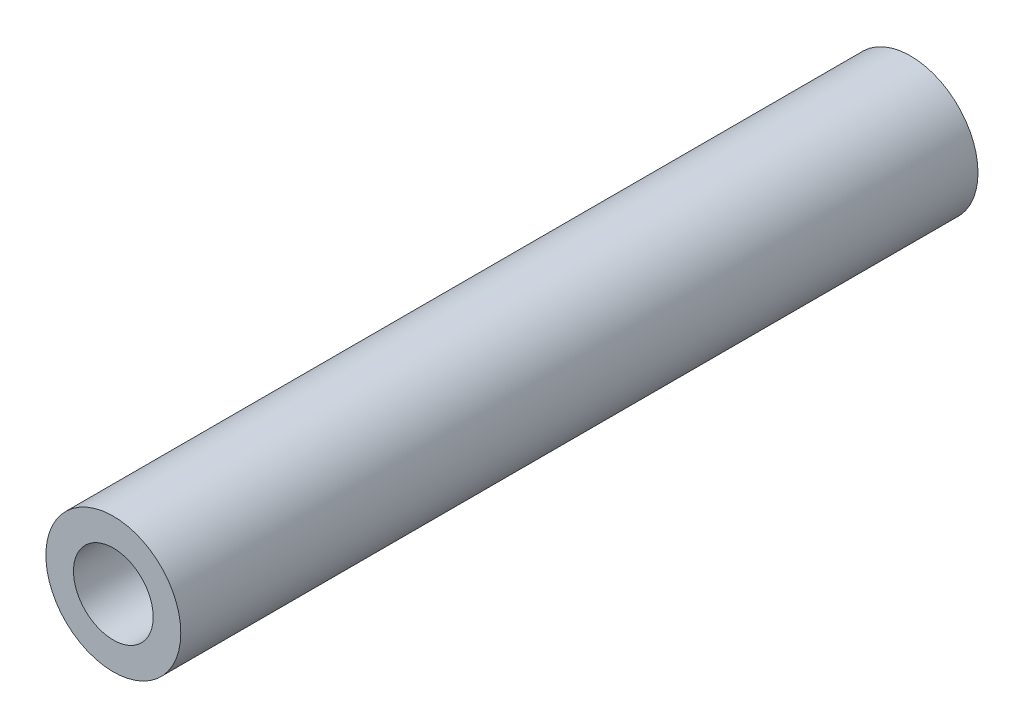
ISO-10303-21;
HEADER;
FILE_DESCRIPTION(('STEP AP214'),'2;1');
FILE_NAME('part.step','',(''),(''),'','','');
FILE_SCHEMA(('AUTOMOTIVE_DESIGN { 1 0 10303 214 1 1 1 1 }'));
ENDSEC;
DATA;
#1=APPLICATION_CONTEXT('core data for automotive mechanical design processes');
#2=APPLICATION_PROTOCOL_DEFINITION('international standard','automotive_design',2000,#1);
#3=PRODUCT_CONTEXT('',#1,'mechanical');
#4=PRODUCT('Part','Part','',(#3));
#5=PRODUCT_RELATED_PRODUCT_CATEGORY('part','',(#4));
#6=PRODUCT_DEFINITION_FORMATION('','',#4);
#7=PRODUCT_DEFINITION_CONTEXT('part definition',#1,'design');
#8=PRODUCT_DEFINITION('design','',#6,#7);
#9=PRODUCT_DEFINITION_SHAPE('','',#8);
#10=(LENGTH_UNIT() NAMED_UNIT(*) SI_UNIT(.MILLI.,.METRE.));
#11=(NAMED_UNIT(*) PLANE_ANGLE_UNIT() SI_UNIT($,.RADIAN.));
#12=(NAMED_UNIT(*) SI_UNIT($,.STERADIAN.) SOLID_ANGLE_UNIT());
#13=UNCERTAINTY_MEASURE_WITH_UNIT(LENGTH_MEASURE(1.E-05),#10,'distance_accuracy_value','');
#14=(GEOMETRIC_REPRESENTATION_CONTEXT(3) GLOBAL_UNCERTAINTY_ASSIGNED_CONTEXT((#13)) GLOBAL_UNIT_ASSIGNED_CONTEXT((#10,
#11,#12)) REPRESENTATION_CONTEXT('',''));
#15=CARTESIAN_POINT('',(0.,0.,0.));
#16=DIRECTION('',(0.,0.,1.));
#17=DIRECTION('',(1.,0.,0.));
#18=AXIS2_PLACEMENT_3D('',#15,#16,#17);
#19=CARTESIAN_POINT('',(0.,0.,130.));
#20=DIRECTION('',(0.,0.,1.));
#21=DIRECTION('',(1.,0.,0.));
#22=AXIS2_PLACEMENT_3D('',#19,#20,#21);
#23=PLANE('',#22);
#24=CARTESIAN_POINT('',(0.,0.,130.));
#25=DIRECTION('',(0.,0.,1.));
#26=DIRECTION('',(1.,0.,0.));
#27=AXIS2_PLACEMENT_3D('',#24,#25,#26);
#28=CIRCLE('',#27,11.);
#29=CARTESIAN_POINT('',(11.,0.,130.));
#30=VERTEX_POINT('',#29);
#31=EDGE_CURVE('E10',#30,#30,#28,.T.);
#32=ORIENTED_EDGE('',*,*,#31,.T.);
#33=EDGE_LOOP('',(#32));
#34=FACE_BOUND('',#33,.T.);
#35=CARTESIAN_POINT('',(0.,0.,130.));
#36=DIRECTION('',(0.,0.,1.));
#37=DIRECTION('',(1.,0.,0.));
#38=AXIS2_PLACEMENT_3D('',#35,#36,#37);
#39=CIRCLE('',#38,6.5);
#40=CARTESIAN_POINT('',(6.5,0.,130.));
#41=VERTEX_POINT('',#40);
#42=EDGE_CURVE('E41',#41,#41,#39,.T.);
#43=ORIENTED_EDGE('',*,*,#42,.F.);
#44=EDGE_LOOP('',(#43));
#45=FACE_BOUND('',#44,.T.);
#46=ADVANCED_FACE('F30',(#34,#45),#23,.T.);
#47=CARTESIAN_POINT('',(0.,0.,0.));
#48=DIRECTION('',(0.,0.,1.));
#49=DIRECTION('',(1.,0.,0.));
#50=AXIS2_PLACEMENT_3D('',#47,#48,#49);
#51=PLANE('',#50);
#52=CARTESIAN_POINT('',(0.,0.,0.));
#53=DIRECTION('',(0.,0.,1.));
#54=DIRECTION('',(1.,0.,0.));
#55=AXIS2_PLACEMENT_3D('',#52,#53,#54);
#56=CIRCLE('',#55,11.);
#57=CARTESIAN_POINT('',(11.,0.,0.));
#58=VERTEX_POINT('',#57);
#59=EDGE_CURVE('E34',#58,#58,#56,.T.);
#60=ORIENTED_EDGE('',*,*,#59,.F.);
#61=EDGE_LOOP('',(#60));
#62=FACE_BOUND('',#61,.T.);
#63=CARTESIAN_POINT('',(0.,0.,0.));
#64=DIRECTION('',(0.,0.,1.));
#65=DIRECTION('',(1.,0.,0.));
#66=AXIS2_PLACEMENT_3D('',#63,#64,#65);
#67=CIRCLE('',#66,6.5);
#68=CARTESIAN_POINT('',(6.5,0.,0.));
#69=VERTEX_POINT('',#68);
#70=EDGE_CURVE('E43',#69,#69,#67,.T.);
#71=ORIENTED_EDGE('',*,*,#70,.T.);
#72=EDGE_LOOP('',(#71));
#73=FACE_BOUND('',#72,.T.);
#74=ADVANCED_FACE('F53',(#62,#73),#51,.F.);
#75=CARTESIAN_POINT('',(0.,0.,130.));
#76=DIRECTION('',(0.,0.,-1.));
#77=DIRECTION('',(-1.,0.,0.));
#78=AXIS2_PLACEMENT_3D('',#75,#76,#77);
#79=CYLINDRICAL_SURFACE('',#78,11.);
#80=ORIENTED_EDGE('',*,*,#31,.F.);
#81=EDGE_LOOP('',(#80));
#82=FACE_BOUND('',#81,.T.);
#83=ORIENTED_EDGE('',*,*,#59,.T.);
#84=EDGE_LOOP('',(#83));
#85=FACE_BOUND('',#84,.T.);
#86=ADVANCED_FACE('F32',(#82,#85),#79,.T.);
#87=CARTESIAN_POINT('',(0.,0.,130.));
#88=DIRECTION('',(0.,0.,-1.));
#89=DIRECTION('',(-1.,0.,0.));
#90=AXIS2_PLACEMENT_3D('',#87,#88,#89);
#91=CYLINDRICAL_SURFACE('',#90,6.5);
#92=ORIENTED_EDGE('',*,*,#42,.T.);
#93=EDGE_LOOP('',(#92));
#94=FACE_BOUND('',#93,.T.);
#95=ORIENTED_EDGE('',*,*,#70,.F.);
#96=EDGE_LOOP('',(#95));
#97=FACE_BOUND('',#96,.T.);
#98=ADVANCED_FACE('F49',(#94,#97),#91,.F.);
#99=CLOSED_SHELL('',(#46,#74,#86,#98));
#100=MANIFOLD_SOLID_BREP('B2',#99);
#101=ADVANCED_BREP_SHAPE_REPRESENTATION('',(#18,#100),#14);
#102=SHAPE_DEFINITION_REPRESENTATION(#9,#101);
ENDSEC;
END-ISO-10303-21;
